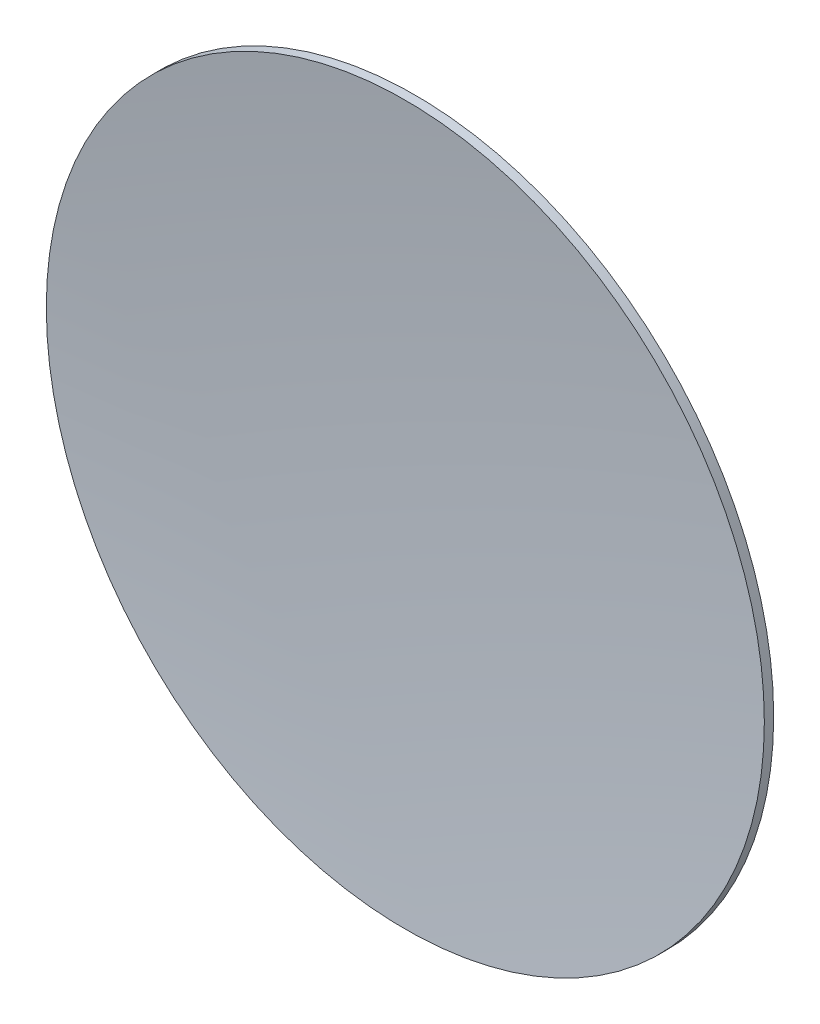
ISO-10303-21;
HEADER;
FILE_DESCRIPTION(('STEP AP214'),'2;1');
FILE_NAME('part.step','',(''),(''),'','','');
FILE_SCHEMA(('AUTOMOTIVE_DESIGN { 1 0 10303 214 1 1 1 1 }'));
ENDSEC;
DATA;
#1=APPLICATION_CONTEXT('core data for automotive mechanical design processes');
#2=APPLICATION_PROTOCOL_DEFINITION('international standard','automotive_design',2000,#1);
#3=PRODUCT_CONTEXT('',#1,'mechanical');
#4=PRODUCT('Part','Part','',(#3));
#5=PRODUCT_RELATED_PRODUCT_CATEGORY('part','',(#4));
#6=PRODUCT_DEFINITION_FORMATION('','',#4);
#7=PRODUCT_DEFINITION_CONTEXT('part definition',#1,'design');
#8=PRODUCT_DEFINITION('design','',#6,#7);
#9=PRODUCT_DEFINITION_SHAPE('','',#8);
#10=(LENGTH_UNIT() NAMED_UNIT(*) SI_UNIT(.MILLI.,.METRE.));
#11=(NAMED_UNIT(*) PLANE_ANGLE_UNIT() SI_UNIT($,.RADIAN.));
#12=(NAMED_UNIT(*) SI_UNIT($,.STERADIAN.) SOLID_ANGLE_UNIT());
#13=UNCERTAINTY_MEASURE_WITH_UNIT(LENGTH_MEASURE(1.E-05),#10,'distance_accuracy_value','');
#14=(GEOMETRIC_REPRESENTATION_CONTEXT(3) GLOBAL_UNCERTAINTY_ASSIGNED_CONTEXT((#13)) GLOBAL_UNIT_ASSIGNED_CONTEXT((#10,
#11,#12)) REPRESENTATION_CONTEXT('',''));
#15=CARTESIAN_POINT('',(0.,0.,0.));
#16=DIRECTION('',(0.,0.,1.));
#17=DIRECTION('',(1.,0.,0.));
#18=AXIS2_PLACEMENT_3D('',#15,#16,#17);
#19=CARTESIAN_POINT('',(0.,0.,2.));
#20=DIRECTION('',(0.,0.,-1.));
#21=DIRECTION('',(-1.,0.,0.));
#22=AXIS2_PLACEMENT_3D('',#19,#20,#21);
#23=CYLINDRICAL_SURFACE('',#22,19.3);
#24=CARTESIAN_POINT('',(0.,0.,0.999999999999973));
#25=DIRECTION('',(0.,0.,1.));
#26=DIRECTION('',(1.,0.,0.));
#27=AXIS2_PLACEMENT_3D('',#24,#25,#26);
#28=CIRCLE('',#27,19.3);
#29=CARTESIAN_POINT('',(19.3,0.,0.999999999999973));
#30=VERTEX_POINT('',#29);
#31=EDGE_CURVE('E11',#30,#30,#28,.F.);
#32=ORIENTED_EDGE('',*,*,#31,.F.);
#33=EDGE_LOOP('',(#32));
#34=FACE_BOUND('',#33,.T.);
#35=CARTESIAN_POINT('',(0.,0.,1.50269914784587));
#36=DIRECTION('',(0.,0.,1.));
#37=DIRECTION('',(1.,0.,0.));
#38=AXIS2_PLACEMENT_3D('',#35,#36,#37);
#39=CIRCLE('',#38,19.3);
#40=CARTESIAN_POINT('',(19.3,0.,1.50269914784587));
#41=VERTEX_POINT('',#40);
#42=EDGE_CURVE('E40',#41,#41,#39,.T.);
#43=ORIENTED_EDGE('',*,*,#42,.F.);
#44=EDGE_LOOP('',(#43));
#45=FACE_BOUND('',#44,.T.);
#46=ADVANCED_FACE('F37',(#34,#45),#23,.T.);
#47=CARTESIAN_POINT('',(0.,0.,186.745));
#48=DIRECTION('',(0.,0.,-1.));
#49=DIRECTION('',(-1.,0.,0.));
#50=AXIS2_PLACEMENT_3D('',#47,#48,#49);
#51=SPHERICAL_SURFACE('',#50,186.745);
#52=CARTESIAN_POINT('',(0.,0.,0.));
#53=VERTEX_POINT('',#52);
#54=VERTEX_LOOP('',#53);
#55=FACE_BOUND('',#54,.T.);
#56=ORIENTED_EDGE('',*,*,#31,.T.);
#57=EDGE_LOOP('',(#56));
#58=FACE_BOUND('',#57,.T.);
#59=ADVANCED_FACE('F47',(#55,#58),#51,.T.);
#60=CARTESIAN_POINT('',(0.,0.,186.745));
#61=DIRECTION('',(0.,0.,-1.));
#62=DIRECTION('',(1.,0.,0.));
#63=AXIS2_PLACEMENT_3D('',#60,#61,#62);
#64=SPHERICAL_SURFACE('',#63,186.245);
#65=ORIENTED_EDGE('',*,*,#42,.T.);
#66=EDGE_LOOP('',(#65));
#67=FACE_BOUND('',#66,.T.);
#68=ADVANCED_FACE('F50',(#67),#64,.F.);
#69=CLOSED_SHELL('',(#46,#59,#68));
#70=MANIFOLD_SOLID_BREP('B2',#69);
#71=ADVANCED_BREP_SHAPE_REPRESENTATION('',(#18,#70),#14);
#72=SHAPE_DEFINITION_REPRESENTATION(#9,#71);
ENDSEC;
END-ISO-10303-21;
